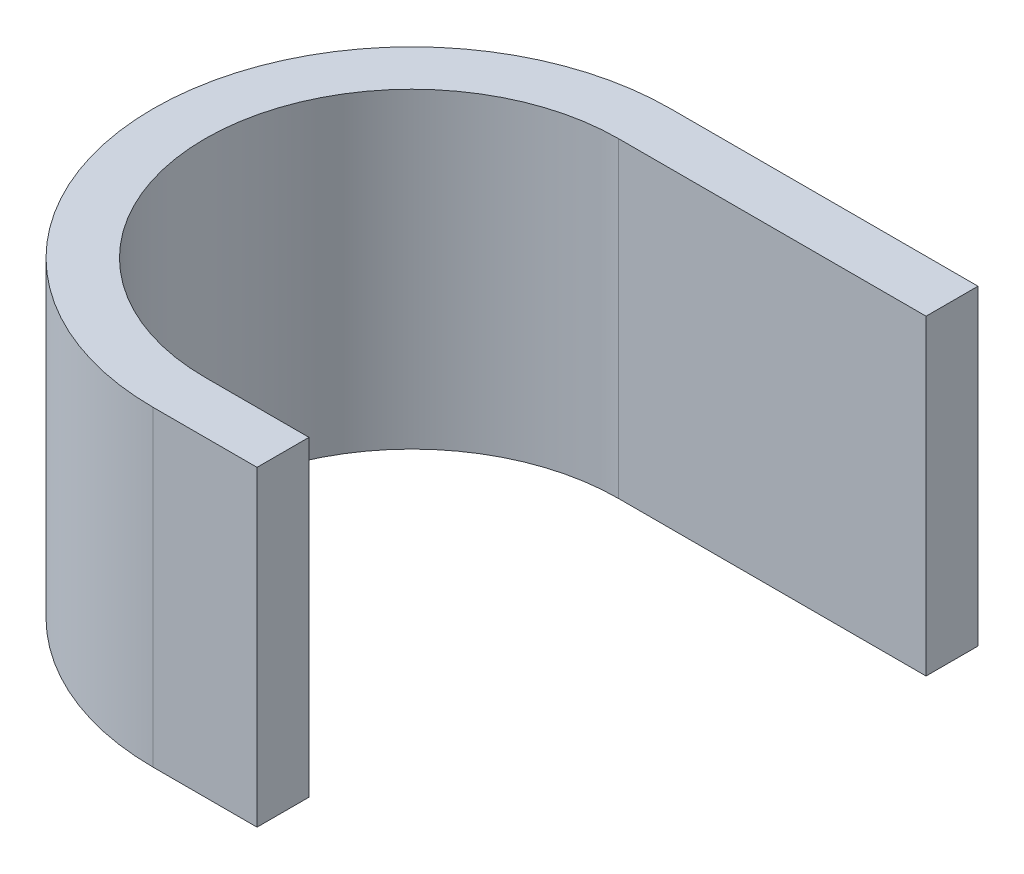
ISO-10303-21;
HEADER;
FILE_DESCRIPTION(('STEP AP214'),'2;1');
FILE_NAME('part.step','',(''),(''),'','','');
FILE_SCHEMA(('AUTOMOTIVE_DESIGN { 1 0 10303 214 1 1 1 1 }'));
ENDSEC;
DATA;
#1=APPLICATION_CONTEXT('core data for automotive mechanical design processes');
#2=APPLICATION_PROTOCOL_DEFINITION('international standard','automotive_design',2000,#1);
#3=PRODUCT_CONTEXT('',#1,'mechanical');
#4=PRODUCT('Part','Part','',(#3));
#5=PRODUCT_RELATED_PRODUCT_CATEGORY('part','',(#4));
#6=PRODUCT_DEFINITION_FORMATION('','',#4);
#7=PRODUCT_DEFINITION_CONTEXT('part definition',#1,'design');
#8=PRODUCT_DEFINITION('design','',#6,#7);
#9=PRODUCT_DEFINITION_SHAPE('','',#8);
#10=(LENGTH_UNIT() NAMED_UNIT(*) SI_UNIT(.MILLI.,.METRE.));
#11=(NAMED_UNIT(*) PLANE_ANGLE_UNIT() SI_UNIT($,.RADIAN.));
#12=(NAMED_UNIT(*) SI_UNIT($,.STERADIAN.) SOLID_ANGLE_UNIT());
#13=UNCERTAINTY_MEASURE_WITH_UNIT(LENGTH_MEASURE(1.E-05),#10,'distance_accuracy_value','');
#14=(GEOMETRIC_REPRESENTATION_CONTEXT(3) GLOBAL_UNCERTAINTY_ASSIGNED_CONTEXT((#13)) GLOBAL_UNIT_ASSIGNED_CONTEXT((#10,
#11,#12)) REPRESENTATION_CONTEXT('',''));
#15=CARTESIAN_POINT('',(0.,0.,0.));
#16=DIRECTION('',(0.,0.,1.));
#17=DIRECTION('',(1.,0.,0.));
#18=AXIS2_PLACEMENT_3D('',#15,#16,#17);
#19=CARTESIAN_POINT('',(29.6,30.,-19.9));
#20=DIRECTION('',(-1.,0.,0.));
#21=DIRECTION('',(0.,0.,1.));
#22=AXIS2_PLACEMENT_3D('',#19,#20,#21);
#23=PLANE('',#22);
#24=DIRECTION('',(0.,0.,-1.));
#25=VECTOR('',#24,1.);
#26=CARTESIAN_POINT('',(29.6,0.,-19.9));
#27=LINE('',#26,#25);
#28=CARTESIAN_POINT('',(29.6,0.,-19.9));
#29=VERTEX_POINT('',#28);
#30=CARTESIAN_POINT('',(29.6,0.,-24.9));
#31=VERTEX_POINT('',#30);
#32=EDGE_CURVE('E133',#29,#31,#27,.T.);
#33=ORIENTED_EDGE('',*,*,#32,.T.);
#34=DIRECTION('',(0.,-1.,0.));
#35=VECTOR('',#34,1.);
#36=CARTESIAN_POINT('',(29.6,30.,-24.9));
#37=LINE('',#36,#35);
#38=CARTESIAN_POINT('',(29.6,30.,-24.9));
#39=VERTEX_POINT('',#38);
#40=EDGE_CURVE('E11',#39,#31,#37,.T.);
#41=ORIENTED_EDGE('',*,*,#40,.F.);
#42=DIRECTION('',(0.,0.,-1.));
#43=VECTOR('',#42,1.);
#44=CARTESIAN_POINT('',(29.6,30.,-19.9));
#45=LINE('',#44,#43);
#46=CARTESIAN_POINT('',(29.6,30.,-19.9));
#47=VERTEX_POINT('',#46);
#48=EDGE_CURVE('E147',#47,#39,#45,.T.);
#49=ORIENTED_EDGE('',*,*,#48,.F.);
#50=DIRECTION('',(0.,-1.,0.));
#51=VECTOR('',#50,1.);
#52=CARTESIAN_POINT('',(29.6,30.,-19.9));
#53=LINE('',#52,#51);
#54=EDGE_CURVE('E129',#47,#29,#53,.T.);
#55=ORIENTED_EDGE('',*,*,#54,.T.);
#56=EDGE_LOOP('',(#33,#41,#49,#55));
#57=FACE_BOUND('',#56,.T.);
#58=ADVANCED_FACE('F37',(#57),#23,.F.);
#59=CARTESIAN_POINT('',(0.,30.,-24.9));
#60=DIRECTION('',(0.,0.,1.));
#61=DIRECTION('',(1.,0.,0.));
#62=AXIS2_PLACEMENT_3D('',#59,#60,#61);
#63=PLANE('',#62);
#64=DIRECTION('',(-1.,0.,0.));
#65=VECTOR('',#64,1.);
#66=CARTESIAN_POINT('',(0.,0.,-24.9));
#67=LINE('',#66,#65);
#68=CARTESIAN_POINT('',(0.,0.,-24.9));
#69=VERTEX_POINT('',#68);
#70=EDGE_CURVE('E136',#31,#69,#67,.T.);
#71=ORIENTED_EDGE('',*,*,#70,.T.);
#72=DIRECTION('',(0.,-1.,0.));
#73=VECTOR('',#72,1.);
#74=CARTESIAN_POINT('',(0.,30.,-24.9));
#75=LINE('',#74,#73);
#76=CARTESIAN_POINT('',(0.,30.,-24.9));
#77=VERTEX_POINT('',#76);
#78=EDGE_CURVE('E45',#77,#69,#75,.T.);
#79=ORIENTED_EDGE('',*,*,#78,.F.);
#80=DIRECTION('',(-1.,0.,0.));
#81=VECTOR('',#80,1.);
#82=CARTESIAN_POINT('',(0.,30.,-24.9));
#83=LINE('',#82,#81);
#84=EDGE_CURVE('E96',#39,#77,#83,.T.);
#85=ORIENTED_EDGE('',*,*,#84,.F.);
#86=ORIENTED_EDGE('',*,*,#40,.T.);
#87=EDGE_LOOP('',(#71,#79,#85,#86));
#88=FACE_BOUND('',#87,.T.);
#89=ADVANCED_FACE('F182',(#88),#63,.F.);
#90=CARTESIAN_POINT('',(0.,30.,0.));
#91=DIRECTION('',(0.,-1.,0.));
#92=DIRECTION('',(0.,0.,-1.));
#93=AXIS2_PLACEMENT_3D('',#90,#91,#92);
#94=CYLINDRICAL_SURFACE('',#93,24.9);
#95=CARTESIAN_POINT('',(0.,0.,0.));
#96=DIRECTION('',(0.,1.,0.));
#97=DIRECTION('',(0.,0.,1.));
#98=AXIS2_PLACEMENT_3D('',#95,#96,#97);
#99=CIRCLE('',#98,24.9);
#100=CARTESIAN_POINT('',(0.,0.,24.9));
#101=VERTEX_POINT('',#100);
#102=EDGE_CURVE('E138',#69,#101,#99,.T.);
#103=ORIENTED_EDGE('',*,*,#102,.T.);
#104=DIRECTION('',(0.,-1.,0.));
#105=VECTOR('',#104,1.);
#106=CARTESIAN_POINT('',(0.,30.,24.9));
#107=LINE('',#106,#105);
#108=CARTESIAN_POINT('',(0.,30.,24.9));
#109=VERTEX_POINT('',#108);
#110=EDGE_CURVE('E154',#109,#101,#107,.T.);
#111=ORIENTED_EDGE('',*,*,#110,.F.);
#112=CARTESIAN_POINT('',(0.,30.,0.));
#113=DIRECTION('',(0.,1.,0.));
#114=DIRECTION('',(0.,0.,1.));
#115=AXIS2_PLACEMENT_3D('',#112,#113,#114);
#116=CIRCLE('',#115,24.9);
#117=EDGE_CURVE('E162',#77,#109,#116,.T.);
#118=ORIENTED_EDGE('',*,*,#117,.F.);
#119=ORIENTED_EDGE('',*,*,#78,.T.);
#120=EDGE_LOOP('',(#103,#111,#118,#119));
#121=FACE_BOUND('',#120,.T.);
#122=ADVANCED_FACE('F160',(#121),#94,.T.);
#123=CARTESIAN_POINT('',(0.,30.,24.9));
#124=DIRECTION('',(0.,0.,-1.));
#125=DIRECTION('',(-1.,0.,0.));
#126=AXIS2_PLACEMENT_3D('',#123,#124,#125);
#127=PLANE('',#126);
#128=DIRECTION('',(1.,0.,0.));
#129=VECTOR('',#128,1.);
#130=CARTESIAN_POINT('',(0.,0.,24.9));
#131=LINE('',#130,#129);
#132=CARTESIAN_POINT('',(10.,0.,24.9));
#133=VERTEX_POINT('',#132);
#134=EDGE_CURVE('E140',#101,#133,#131,.T.);
#135=ORIENTED_EDGE('',*,*,#134,.T.);
#136=DIRECTION('',(0.,-1.,0.));
#137=VECTOR('',#136,1.);
#138=CARTESIAN_POINT('',(10.,30.,24.9));
#139=LINE('',#138,#137);
#140=CARTESIAN_POINT('',(10.,30.,24.9));
#141=VERTEX_POINT('',#140);
#142=EDGE_CURVE('E151',#141,#133,#139,.T.);
#143=ORIENTED_EDGE('',*,*,#142,.F.);
#144=DIRECTION('',(1.,0.,0.));
#145=VECTOR('',#144,1.);
#146=CARTESIAN_POINT('',(0.,30.,24.9));
#147=LINE('',#146,#145);
#148=EDGE_CURVE('E174',#109,#141,#147,.T.);
#149=ORIENTED_EDGE('',*,*,#148,.F.);
#150=ORIENTED_EDGE('',*,*,#110,.T.);
#151=EDGE_LOOP('',(#135,#143,#149,#150));
#152=FACE_BOUND('',#151,.T.);
#153=ADVANCED_FACE('F170',(#152),#127,.F.);
#154=CARTESIAN_POINT('',(10.,30.,24.9));
#155=DIRECTION('',(-1.,0.,0.));
#156=DIRECTION('',(0.,0.,1.));
#157=AXIS2_PLACEMENT_3D('',#154,#155,#156);
#158=PLANE('',#157);
#159=DIRECTION('',(0.,0.,-1.));
#160=VECTOR('',#159,1.);
#161=CARTESIAN_POINT('',(10.,0.,24.9));
#162=LINE('',#161,#160);
#163=CARTESIAN_POINT('',(10.,0.,19.9));
#164=VERTEX_POINT('',#163);
#165=EDGE_CURVE('E142',#133,#164,#162,.T.);
#166=ORIENTED_EDGE('',*,*,#165,.T.);
#167=DIRECTION('',(0.,-1.,0.));
#168=VECTOR('',#167,1.);
#169=CARTESIAN_POINT('',(10.,30.,19.9));
#170=LINE('',#169,#168);
#171=CARTESIAN_POINT('',(10.,30.,19.9));
#172=VERTEX_POINT('',#171);
#173=EDGE_CURVE('E124',#172,#164,#170,.T.);
#174=ORIENTED_EDGE('',*,*,#173,.F.);
#175=DIRECTION('',(0.,0.,-1.));
#176=VECTOR('',#175,1.);
#177=CARTESIAN_POINT('',(10.,30.,24.9));
#178=LINE('',#177,#176);
#179=EDGE_CURVE('E115',#141,#172,#178,.T.);
#180=ORIENTED_EDGE('',*,*,#179,.F.);
#181=ORIENTED_EDGE('',*,*,#142,.T.);
#182=EDGE_LOOP('',(#166,#174,#180,#181));
#183=FACE_BOUND('',#182,.T.);
#184=ADVANCED_FACE('F173',(#183),#158,.F.);
#185=CARTESIAN_POINT('',(0.,30.,19.9));
#186=DIRECTION('',(0.,0.,1.));
#187=DIRECTION('',(1.,0.,0.));
#188=AXIS2_PLACEMENT_3D('',#185,#186,#187);
#189=PLANE('',#188);
#190=DIRECTION('',(-1.,0.,0.));
#191=VECTOR('',#190,1.);
#192=CARTESIAN_POINT('',(0.,0.,19.9));
#193=LINE('',#192,#191);
#194=CARTESIAN_POINT('',(0.,0.,19.9));
#195=VERTEX_POINT('',#194);
#196=EDGE_CURVE('E123',#164,#195,#193,.T.);
#197=ORIENTED_EDGE('',*,*,#196,.T.);
#198=DIRECTION('',(0.,-1.,0.));
#199=VECTOR('',#198,1.);
#200=CARTESIAN_POINT('',(0.,30.,19.9));
#201=LINE('',#200,#199);
#202=CARTESIAN_POINT('',(0.,30.,19.9));
#203=VERTEX_POINT('',#202);
#204=EDGE_CURVE('E120',#203,#195,#201,.T.);
#205=ORIENTED_EDGE('',*,*,#204,.F.);
#206=DIRECTION('',(-1.,0.,0.));
#207=VECTOR('',#206,1.);
#208=CARTESIAN_POINT('',(0.,30.,19.9));
#209=LINE('',#208,#207);
#210=EDGE_CURVE('E109',#172,#203,#209,.T.);
#211=ORIENTED_EDGE('',*,*,#210,.F.);
#212=ORIENTED_EDGE('',*,*,#173,.T.);
#213=EDGE_LOOP('',(#197,#205,#211,#212));
#214=FACE_BOUND('',#213,.T.);
#215=ADVANCED_FACE('F121',(#214),#189,.F.);
#216=CARTESIAN_POINT('',(0.,30.,0.));
#217=DIRECTION('',(0.,-1.,0.));
#218=DIRECTION('',(0.,0.,-1.));
#219=AXIS2_PLACEMENT_3D('',#216,#217,#218);
#220=CYLINDRICAL_SURFACE('',#219,19.9);
#221=CARTESIAN_POINT('',(0.,0.,0.));
#222=DIRECTION('',(0.,-1.,0.));
#223=DIRECTION('',(0.,0.,1.));
#224=AXIS2_PLACEMENT_3D('',#221,#222,#223);
#225=CIRCLE('',#224,19.9);
#226=CARTESIAN_POINT('',(0.,0.,-19.9));
#227=VERTEX_POINT('',#226);
#228=EDGE_CURVE('E82',#195,#227,#225,.T.);
#229=ORIENTED_EDGE('',*,*,#228,.T.);
#230=DIRECTION('',(0.,-1.,0.));
#231=VECTOR('',#230,1.);
#232=CARTESIAN_POINT('',(0.,30.,-19.9));
#233=LINE('',#232,#231);
#234=CARTESIAN_POINT('',(0.,30.,-19.9));
#235=VERTEX_POINT('',#234);
#236=EDGE_CURVE('E125',#235,#227,#233,.T.);
#237=ORIENTED_EDGE('',*,*,#236,.F.);
#238=CARTESIAN_POINT('',(0.,30.,0.));
#239=DIRECTION('',(0.,-1.,0.));
#240=DIRECTION('',(0.,0.,1.));
#241=AXIS2_PLACEMENT_3D('',#238,#239,#240);
#242=CIRCLE('',#241,19.9);
#243=EDGE_CURVE('E113',#203,#235,#242,.T.);
#244=ORIENTED_EDGE('',*,*,#243,.F.);
#245=ORIENTED_EDGE('',*,*,#204,.T.);
#246=EDGE_LOOP('',(#229,#237,#244,#245));
#247=FACE_BOUND('',#246,.T.);
#248=ADVANCED_FACE('F127',(#247),#220,.F.);
#249=CARTESIAN_POINT('',(0.,30.,-19.9));
#250=DIRECTION('',(0.,0.,-1.));
#251=DIRECTION('',(-1.,0.,0.));
#252=AXIS2_PLACEMENT_3D('',#249,#250,#251);
#253=PLANE('',#252);
#254=DIRECTION('',(1.,0.,0.));
#255=VECTOR('',#254,1.);
#256=CARTESIAN_POINT('',(0.,0.,-19.9));
#257=LINE('',#256,#255);
#258=EDGE_CURVE('E88',#227,#29,#257,.T.);
#259=ORIENTED_EDGE('',*,*,#258,.T.);
#260=ORIENTED_EDGE('',*,*,#54,.F.);
#261=DIRECTION('',(1.,0.,0.));
#262=VECTOR('',#261,1.);
#263=CARTESIAN_POINT('',(0.,30.,-19.9));
#264=LINE('',#263,#262);
#265=EDGE_CURVE('E53',#235,#47,#264,.T.);
#266=ORIENTED_EDGE('',*,*,#265,.F.);
#267=ORIENTED_EDGE('',*,*,#236,.T.);
#268=EDGE_LOOP('',(#259,#260,#266,#267));
#269=FACE_BOUND('',#268,.T.);
#270=ADVANCED_FACE('F198',(#269),#253,.F.);
#271=CARTESIAN_POINT('',(0.,30.,0.));
#272=DIRECTION('',(0.,1.,0.));
#273=DIRECTION('',(0.,0.,1.));
#274=AXIS2_PLACEMENT_3D('',#271,#272,#273);
#275=PLANE('',#274);
#276=ORIENTED_EDGE('',*,*,#48,.T.);
#277=ORIENTED_EDGE('',*,*,#84,.T.);
#278=ORIENTED_EDGE('',*,*,#117,.T.);
#279=ORIENTED_EDGE('',*,*,#148,.T.);
#280=ORIENTED_EDGE('',*,*,#179,.T.);
#281=ORIENTED_EDGE('',*,*,#210,.T.);
#282=ORIENTED_EDGE('',*,*,#243,.T.);
#283=ORIENTED_EDGE('',*,*,#265,.T.);
#284=EDGE_LOOP('',(#276,#277,#278,#279,#280,#281,#282,#283));
#285=FACE_BOUND('',#284,.T.);
#286=ADVANCED_FACE('F111',(#285),#275,.T.);
#287=CARTESIAN_POINT('',(0.,0.,0.));
#288=DIRECTION('',(0.,1.,0.));
#289=DIRECTION('',(0.,0.,1.));
#290=AXIS2_PLACEMENT_3D('',#287,#288,#289);
#291=PLANE('',#290);
#292=ORIENTED_EDGE('',*,*,#32,.F.);
#293=ORIENTED_EDGE('',*,*,#258,.F.);
#294=ORIENTED_EDGE('',*,*,#228,.F.);
#295=ORIENTED_EDGE('',*,*,#196,.F.);
#296=ORIENTED_EDGE('',*,*,#165,.F.);
#297=ORIENTED_EDGE('',*,*,#134,.F.);
#298=ORIENTED_EDGE('',*,*,#102,.F.);
#299=ORIENTED_EDGE('',*,*,#70,.F.);
#300=EDGE_LOOP('',(#292,#293,#294,#295,#296,#297,#298,#299));
#301=FACE_BOUND('',#300,.T.);
#302=ADVANCED_FACE('F166',(#301),#291,.F.);
#303=CLOSED_SHELL('',(#58,#89,#122,#153,#184,#215,#248,#270,#286,#302));
#304=MANIFOLD_SOLID_BREP('B2',#303);
#305=ADVANCED_BREP_SHAPE_REPRESENTATION('',(#18,#304),#14);
#306=SHAPE_DEFINITION_REPRESENTATION(#9,#305);
ENDSEC;
END-ISO-10303-21;
